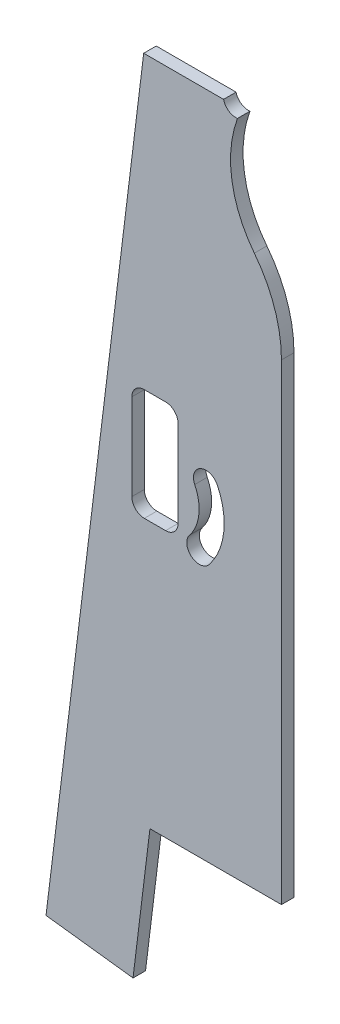
ISO-10303-21;
HEADER;
FILE_DESCRIPTION(('STEP AP214'),'2;1');
FILE_NAME('part.step','',(''),(''),'','','');
FILE_SCHEMA(('AUTOMOTIVE_DESIGN { 1 0 10303 214 1 1 1 1 }'));
ENDSEC;
DATA;
#1=APPLICATION_CONTEXT('core data for automotive mechanical design processes');
#2=APPLICATION_PROTOCOL_DEFINITION('international standard','automotive_design',2000,#1);
#3=PRODUCT_CONTEXT('',#1,'mechanical');
#4=PRODUCT('Part','Part','',(#3));
#5=PRODUCT_RELATED_PRODUCT_CATEGORY('part','',(#4));
#6=PRODUCT_DEFINITION_FORMATION('','',#4);
#7=PRODUCT_DEFINITION_CONTEXT('part definition',#1,'design');
#8=PRODUCT_DEFINITION('design','',#6,#7);
#9=PRODUCT_DEFINITION_SHAPE('','',#8);
#10=(LENGTH_UNIT() NAMED_UNIT(*) SI_UNIT(.MILLI.,.METRE.));
#11=(NAMED_UNIT(*) PLANE_ANGLE_UNIT() SI_UNIT($,.RADIAN.));
#12=(NAMED_UNIT(*) SI_UNIT($,.STERADIAN.) SOLID_ANGLE_UNIT());
#13=UNCERTAINTY_MEASURE_WITH_UNIT(LENGTH_MEASURE(1.E-05),#10,'distance_accuracy_value','');
#14=(GEOMETRIC_REPRESENTATION_CONTEXT(3) GLOBAL_UNCERTAINTY_ASSIGNED_CONTEXT((#13)) GLOBAL_UNIT_ASSIGNED_CONTEXT((#10,
#11,#12)) REPRESENTATION_CONTEXT('',''));
#15=CARTESIAN_POINT('',(0.,0.,0.));
#16=DIRECTION('',(0.,0.,1.));
#17=DIRECTION('',(1.,0.,0.));
#18=AXIS2_PLACEMENT_3D('',#15,#16,#17);
#19=CARTESIAN_POINT('',(0.,0.,6.35));
#20=DIRECTION('',(0.,0.,-1.));
#21=DIRECTION('',(-1.,0.,0.));
#22=AXIS2_PLACEMENT_3D('',#19,#20,#21);
#23=PLANE('',#22);
#24=CARTESIAN_POINT('',(30.6766730209772,334.935994433785,6.35));
#25=DIRECTION('',(0.,0.,-1.));
#26=DIRECTION('',(-1.,0.,0.));
#27=AXIS2_PLACEMENT_3D('',#24,#25,#26);
#28=CIRCLE('',#27,65.0874999999998);
#29=CARTESIAN_POINT('',(82.0161598908012,374.943990436998,6.35));
#30=VERTEX_POINT('',#29);
#31=CARTESIAN_POINT('',(95.764173020977,334.935994433782,6.35));
#32=VERTEX_POINT('',#31);
#33=EDGE_CURVE('E250',#30,#32,#28,.T.);
#34=ORIENTED_EDGE('',*,*,#33,.F.);
#35=CARTESIAN_POINT('',(127.09473372772,410.072962537381,6.35));
#36=DIRECTION('',(0.,0.,1.));
#37=DIRECTION('',(1.,0.,0.));
#38=AXIS2_PLACEMENT_3D('',#35,#36,#37);
#39=CIRCLE('',#38,57.15);
#40=CARTESIAN_POINT('',(73.4745637946517,429.846679344013,6.35));
#41=VERTEX_POINT('',#40);
#42=EDGE_CURVE('E194',#41,#30,#39,.T.);
#43=ORIENTED_EDGE('',*,*,#42,.F.);
#44=CARTESIAN_POINT('',(72.594859493668,436.13544872624,6.35));
#45=DIRECTION('',(0.,0.,1.));
#46=DIRECTION('',(1.,0.,0.));
#47=AXIS2_PLACEMENT_3D('',#44,#45,#46);
#48=CIRCLE('',#47,6.34999999999999);
#49=CARTESIAN_POINT('',(66.412753154869,434.684910475872,6.35));
#50=VERTEX_POINT('',#49);
#51=EDGE_CURVE('E287',#50,#41,#48,.T.);
#52=ORIENTED_EDGE('',*,*,#51,.F.);
#53=DIRECTION('',(-1.,0.,0.));
#54=VECTOR('',#53,1.);
#55=CARTESIAN_POINT('',(25.9141730209772,434.684910475872,6.35));
#56=LINE('',#55,#54);
#57=CARTESIAN_POINT('',(25.9141730209772,434.684910475872,6.35));
#58=VERTEX_POINT('',#57);
#59=EDGE_CURVE('E312',#50,#58,#56,.T.);
#60=ORIENTED_EDGE('',*,*,#59,.T.);
#61=DIRECTION('',(-0.121869343405144,-0.992546151641322,0.));
#62=VECTOR('',#61,1.);
#63=CARTESIAN_POINT('',(-23.6135281388733,31.3141544488385,6.35));
#64=LINE('',#63,#62);
#65=CARTESIAN_POINT('',(-23.6135281388733,31.3141544488385,6.35));
#66=VERTEX_POINT('',#65);
#67=EDGE_CURVE('E314',#58,#66,#64,.T.);
#68=ORIENTED_EDGE('',*,*,#67,.T.);
#69=DIRECTION('',(0.992546151641323,-0.121869343405143,0.));
#70=VECTOR('',#69,1.);
#71=CARTESIAN_POINT('',(20.5051483015834,25.8970621344799,6.35));
#72=LINE('',#71,#70);
#73=CARTESIAN_POINT('',(20.5051483015834,25.8970621344799,6.35));
#74=VERTEX_POINT('',#73);
#75=EDGE_CURVE('E316',#66,#74,#72,.T.);
#76=ORIENTED_EDGE('',*,*,#75,.T.);
#77=DIRECTION('',(0.121869343405143,0.992546151641323,0.));
#78=VECTOR('',#77,1.);
#79=CARTESIAN_POINT('',(29.081649880651,95.7470621344798,6.35));
#80=LINE('',#79,#78);
#81=CARTESIAN_POINT('',(29.081649880651,95.7470621344798,6.35));
#82=VERTEX_POINT('',#81);
#83=EDGE_CURVE('E303',#74,#82,#80,.T.);
#84=ORIENTED_EDGE('',*,*,#83,.T.);
#85=DIRECTION('',(1.,0.,0.));
#86=VECTOR('',#85,1.);
#87=CARTESIAN_POINT('',(95.7641730209773,95.7470621344799,6.35));
#88=LINE('',#87,#86);
#89=CARTESIAN_POINT('',(95.7641730209773,95.7470621344799,6.35));
#90=VERTEX_POINT('',#89);
#91=EDGE_CURVE('E306',#82,#90,#88,.T.);
#92=ORIENTED_EDGE('',*,*,#91,.T.);
#93=DIRECTION('',(0.,1.,0.));
#94=VECTOR('',#93,1.);
#95=CARTESIAN_POINT('',(95.7641730209773,95.7470621344799,6.35));
#96=LINE('',#95,#94);
#97=EDGE_CURVE('E309',#90,#32,#96,.T.);
#98=ORIENTED_EDGE('',*,*,#97,.T.);
#99=EDGE_LOOP('',(#34,#43,#52,#60,#68,#76,#84,#92,#98));
#100=FACE_BOUND('',#99,.T.);
#101=CARTESIAN_POINT('',(57.4996611278624,261.012649670213,6.35));
#102=DIRECTION('',(0.,0.,1.));
#103=DIRECTION('',(1.,0.,0.));
#104=AXIS2_PLACEMENT_3D('',#101,#102,#103);
#105=CIRCLE('',#104,6.34999999999979);
#106=CARTESIAN_POINT('',(63.2131029293924,263.783765470847,6.35));
#107=VERTEX_POINT('',#106);
#108=CARTESIAN_POINT('',(51.7862193263348,258.241533869578,6.35));
#109=VERTEX_POINT('',#108);
#110=EDGE_CURVE('E277',#107,#109,#105,.T.);
#111=ORIENTED_EDGE('',*,*,#110,.F.);
#112=CARTESIAN_POINT('',(31.7891730209766,248.542628567356,6.35));
#113=DIRECTION('',(0.,0.,1.));
#114=DIRECTION('',(1.,0.,0.));
#115=AXIS2_PLACEMENT_3D('',#112,#113,#114);
#116=CIRCLE('',#115,34.9249999999999);
#117=CARTESIAN_POINT('',(59.0699609703519,226.736339707002,6.35));
#118=VERTEX_POINT('',#117);
#119=EDGE_CURVE('E259',#118,#107,#116,.T.);
#120=ORIENTED_EDGE('',*,*,#119,.F.);
#121=CARTESIAN_POINT('',(54.1098177068291,230.701119499794,6.35));
#122=DIRECTION('',(0.,0.,1.));
#123=DIRECTION('',(1.,0.,0.));
#124=AXIS2_PLACEMENT_3D('',#121,#122,#123);
#125=CIRCLE('',#124,6.34999999999796);
#126=CARTESIAN_POINT('',(49.1496744433093,234.665899292585,6.35));
#127=VERTEX_POINT('',#126);
#128=EDGE_CURVE('E266',#127,#118,#125,.T.);
#129=ORIENTED_EDGE('',*,*,#128,.F.);
#130=CARTESIAN_POINT('',(31.7891730209766,248.542628567356,6.35));
#131=DIRECTION('',(0.,0.,1.));
#132=DIRECTION('',(1.,0.,0.));
#133=AXIS2_PLACEMENT_3D('',#130,#131,#132);
#134=CIRCLE('',#133,22.2250000000022);
#135=EDGE_CURVE('E280',#127,#109,#134,.T.);
#136=ORIENTED_EDGE('',*,*,#135,.T.);
#137=EDGE_LOOP('',(#111,#120,#129,#136));
#138=FACE_BOUND('',#137,.T.);
#139=DIRECTION('',(1.,0.,0.));
#140=VECTOR('',#139,1.);
#141=CARTESIAN_POINT('',(26.2316730209777,287.120128567355,6.35));
#142=LINE('',#141,#140);
#143=CARTESIAN_POINT('',(26.2316730209777,287.120128567355,6.35));
#144=VERTEX_POINT('',#143);
#145=CARTESIAN_POINT('',(37.0266730209772,287.120128567355,6.35));
#146=VERTEX_POINT('',#145);
#147=EDGE_CURVE('E50',#144,#146,#142,.T.);
#148=ORIENTED_EDGE('',*,*,#147,.T.);
#149=CARTESIAN_POINT('',(37.0266730209772,280.770128567355,6.35));
#150=DIRECTION('',(0.,0.,-1.));
#151=DIRECTION('',(-1.,0.,0.));
#152=AXIS2_PLACEMENT_3D('',#149,#150,#151);
#153=CIRCLE('',#152,6.35000000000004);
#154=CARTESIAN_POINT('',(43.3766730209772,280.770128567355,6.35));
#155=VERTEX_POINT('',#154);
#156=EDGE_CURVE('E193',#146,#155,#153,.T.);
#157=ORIENTED_EDGE('',*,*,#156,.T.);
#158=DIRECTION('',(0.,-1.,0.));
#159=VECTOR('',#158,1.);
#160=CARTESIAN_POINT('',(43.3766730209772,280.770128567355,6.35));
#161=LINE('',#160,#159);
#162=CARTESIAN_POINT('',(43.3766730209772,236.955128567356,6.35));
#163=VERTEX_POINT('',#162);
#164=EDGE_CURVE('E217',#155,#163,#161,.T.);
#165=ORIENTED_EDGE('',*,*,#164,.T.);
#166=CARTESIAN_POINT('',(37.0266730209772,236.955128567356,6.35));
#167=DIRECTION('',(0.,0.,1.));
#168=DIRECTION('',(1.,0.,0.));
#169=AXIS2_PLACEMENT_3D('',#166,#167,#168);
#170=CIRCLE('',#169,6.34999999999999);
#171=CARTESIAN_POINT('',(37.0266730209772,230.605128567356,6.35));
#172=VERTEX_POINT('',#171);
#173=EDGE_CURVE('E220',#172,#163,#170,.T.);
#174=ORIENTED_EDGE('',*,*,#173,.F.);
#175=DIRECTION('',(1.,0.,0.));
#176=VECTOR('',#175,1.);
#177=CARTESIAN_POINT('',(26.2316730209777,230.605128567356,6.35));
#178=LINE('',#177,#176);
#179=CARTESIAN_POINT('',(26.2316730209777,230.605128567356,6.35));
#180=VERTEX_POINT('',#179);
#181=EDGE_CURVE('E223',#180,#172,#178,.T.);
#182=ORIENTED_EDGE('',*,*,#181,.F.);
#183=CARTESIAN_POINT('',(26.2316730209777,236.955128567356,6.35));
#184=DIRECTION('',(0.,0.,1.));
#185=DIRECTION('',(1.,0.,0.));
#186=AXIS2_PLACEMENT_3D('',#183,#184,#185);
#187=CIRCLE('',#186,6.35);
#188=CARTESIAN_POINT('',(19.8816730209777,236.955128567356,6.35));
#189=VERTEX_POINT('',#188);
#190=EDGE_CURVE('E226',#189,#180,#187,.T.);
#191=ORIENTED_EDGE('',*,*,#190,.F.);
#192=DIRECTION('',(0.,-1.,0.));
#193=VECTOR('',#192,1.);
#194=CARTESIAN_POINT('',(19.8816730209777,280.770128567355,6.35));
#195=LINE('',#194,#193);
#196=CARTESIAN_POINT('',(19.8816730209777,280.770128567355,6.35));
#197=VERTEX_POINT('',#196);
#198=EDGE_CURVE('E229',#197,#189,#195,.T.);
#199=ORIENTED_EDGE('',*,*,#198,.F.);
#200=CARTESIAN_POINT('',(26.2316730209777,280.770128567355,6.35));
#201=DIRECTION('',(0.,0.,1.));
#202=DIRECTION('',(1.,0.,0.));
#203=AXIS2_PLACEMENT_3D('',#200,#201,#202);
#204=CIRCLE('',#203,6.35000000000001);
#205=EDGE_CURVE('E187',#144,#197,#204,.T.);
#206=ORIENTED_EDGE('',*,*,#205,.F.);
#207=EDGE_LOOP('',(#148,#157,#165,#174,#182,#191,#199,#206));
#208=FACE_BOUND('',#207,.T.);
#209=ADVANCED_FACE('F35',(#100,#138,#208),#23,.F.);
#210=CARTESIAN_POINT('',(0.,0.,0.));
#211=DIRECTION('',(0.,0.,-1.));
#212=DIRECTION('',(-1.,0.,0.));
#213=AXIS2_PLACEMENT_3D('',#210,#211,#212);
#214=PLANE('',#213);
#215=CARTESIAN_POINT('',(31.7891730209766,248.542628567356,0.));
#216=DIRECTION('',(0.,0.,1.));
#217=DIRECTION('',(1.,0.,0.));
#218=AXIS2_PLACEMENT_3D('',#215,#216,#217);
#219=CIRCLE('',#218,34.9249999999999);
#220=CARTESIAN_POINT('',(59.0699609703519,226.736339707002,0.));
#221=VERTEX_POINT('',#220);
#222=CARTESIAN_POINT('',(63.2131029293925,263.783765470847,0.));
#223=VERTEX_POINT('',#222);
#224=EDGE_CURVE('E262',#221,#223,#219,.T.);
#225=ORIENTED_EDGE('',*,*,#224,.T.);
#226=CARTESIAN_POINT('',(57.4996611278624,261.012649670213,0.));
#227=DIRECTION('',(0.,0.,1.));
#228=DIRECTION('',(1.,0.,0.));
#229=AXIS2_PLACEMENT_3D('',#226,#227,#228);
#230=CIRCLE('',#229,6.34999999999979);
#231=CARTESIAN_POINT('',(51.786219326333,258.241533869577,0.));
#232=VERTEX_POINT('',#231);
#233=EDGE_CURVE('E265',#223,#232,#230,.T.);
#234=ORIENTED_EDGE('',*,*,#233,.T.);
#235=CARTESIAN_POINT('',(31.7891730209766,248.542628567356,0.));
#236=DIRECTION('',(0.,0.,1.));
#237=DIRECTION('',(1.,0.,0.));
#238=AXIS2_PLACEMENT_3D('',#235,#236,#237);
#239=CIRCLE('',#238,22.2250000000022);
#240=CARTESIAN_POINT('',(49.1496744433093,234.665899292585,0.));
#241=VERTEX_POINT('',#240);
#242=EDGE_CURVE('E269',#241,#232,#239,.T.);
#243=ORIENTED_EDGE('',*,*,#242,.F.);
#244=CARTESIAN_POINT('',(54.1098177068291,230.701119499794,0.));
#245=DIRECTION('',(0.,0.,1.));
#246=DIRECTION('',(1.,0.,0.));
#247=AXIS2_PLACEMENT_3D('',#244,#245,#246);
#248=CIRCLE('',#247,6.34999999999796);
#249=EDGE_CURVE('E272',#241,#221,#248,.T.);
#250=ORIENTED_EDGE('',*,*,#249,.T.);
#251=EDGE_LOOP('',(#225,#234,#243,#250));
#252=FACE_BOUND('',#251,.T.);
#253=CARTESIAN_POINT('',(127.09473372772,410.072962537381,0.));
#254=DIRECTION('',(0.,0.,1.));
#255=DIRECTION('',(1.,0.,0.));
#256=AXIS2_PLACEMENT_3D('',#253,#254,#255);
#257=CIRCLE('',#256,57.15);
#258=CARTESIAN_POINT('',(73.4745637946517,429.846679344013,0.));
#259=VERTEX_POINT('',#258);
#260=CARTESIAN_POINT('',(82.0161598908012,374.943990436998,0.));
#261=VERTEX_POINT('',#260);
#262=EDGE_CURVE('E246',#259,#261,#257,.T.);
#263=ORIENTED_EDGE('',*,*,#262,.T.);
#264=CARTESIAN_POINT('',(30.6766730209772,334.935994433785,0.));
#265=DIRECTION('',(0.,0.,-1.));
#266=DIRECTION('',(-1.,0.,0.));
#267=AXIS2_PLACEMENT_3D('',#264,#265,#266);
#268=CIRCLE('',#267,65.0874999999998);
#269=CARTESIAN_POINT('',(95.764173020977,334.935994433782,0.));
#270=VERTEX_POINT('',#269);
#271=EDGE_CURVE('E249',#261,#270,#268,.T.);
#272=ORIENTED_EDGE('',*,*,#271,.T.);
#273=DIRECTION('',(0.,1.,0.));
#274=VECTOR('',#273,1.);
#275=CARTESIAN_POINT('',(95.7641730209773,95.7470621344799,0.));
#276=LINE('',#275,#274);
#277=CARTESIAN_POINT('',(95.7641730209773,95.7470621344799,0.));
#278=VERTEX_POINT('',#277);
#279=EDGE_CURVE('E323',#278,#270,#276,.T.);
#280=ORIENTED_EDGE('',*,*,#279,.F.);
#281=DIRECTION('',(1.,0.,0.));
#282=VECTOR('',#281,1.);
#283=CARTESIAN_POINT('',(95.7641730209773,95.7470621344799,0.));
#284=LINE('',#283,#282);
#285=CARTESIAN_POINT('',(29.081649880651,95.7470621344798,0.));
#286=VERTEX_POINT('',#285);
#287=EDGE_CURVE('E321',#286,#278,#284,.T.);
#288=ORIENTED_EDGE('',*,*,#287,.F.);
#289=DIRECTION('',(0.121869343405143,0.992546151641323,0.));
#290=VECTOR('',#289,1.);
#291=CARTESIAN_POINT('',(29.081649880651,95.7470621344798,0.));
#292=LINE('',#291,#290);
#293=CARTESIAN_POINT('',(20.5051483015834,25.8970621344799,0.));
#294=VERTEX_POINT('',#293);
#295=EDGE_CURVE('E302',#294,#286,#292,.T.);
#296=ORIENTED_EDGE('',*,*,#295,.F.);
#297=DIRECTION('',(0.992546151641323,-0.121869343405143,0.));
#298=VECTOR('',#297,1.);
#299=CARTESIAN_POINT('',(20.5051483015834,25.8970621344799,0.));
#300=LINE('',#299,#298);
#301=CARTESIAN_POINT('',(-23.6135281388733,31.3141544488385,0.));
#302=VERTEX_POINT('',#301);
#303=EDGE_CURVE('E307',#302,#294,#300,.T.);
#304=ORIENTED_EDGE('',*,*,#303,.F.);
#305=DIRECTION('',(-0.121869343405144,-0.992546151641322,0.));
#306=VECTOR('',#305,1.);
#307=CARTESIAN_POINT('',(-23.6135281388733,31.3141544488385,0.));
#308=LINE('',#307,#306);
#309=CARTESIAN_POINT('',(25.9141730209772,434.684910475872,0.));
#310=VERTEX_POINT('',#309);
#311=EDGE_CURVE('E328',#310,#302,#308,.T.);
#312=ORIENTED_EDGE('',*,*,#311,.F.);
#313=DIRECTION('',(-1.,0.,0.));
#314=VECTOR('',#313,1.);
#315=CARTESIAN_POINT('',(25.9141730209772,434.684910475872,0.));
#316=LINE('',#315,#314);
#317=CARTESIAN_POINT('',(66.412753154869,434.684910475872,0.));
#318=VERTEX_POINT('',#317);
#319=EDGE_CURVE('E326',#318,#310,#316,.T.);
#320=ORIENTED_EDGE('',*,*,#319,.F.);
#321=CARTESIAN_POINT('',(72.594859493668,436.13544872624,0.));
#322=DIRECTION('',(0.,0.,1.));
#323=DIRECTION('',(1.,0.,0.));
#324=AXIS2_PLACEMENT_3D('',#321,#322,#323);
#325=CIRCLE('',#324,6.34999999999999);
#326=EDGE_CURVE('E294',#318,#259,#325,.T.);
#327=ORIENTED_EDGE('',*,*,#326,.T.);
#328=EDGE_LOOP('',(#263,#272,#280,#288,#296,#304,#312,#320,#327));
#329=FACE_BOUND('',#328,.T.);
#330=CARTESIAN_POINT('',(37.0266730209772,280.770128567355,0.));
#331=DIRECTION('',(0.,0.,-1.));
#332=DIRECTION('',(-1.,0.,0.));
#333=AXIS2_PLACEMENT_3D('',#330,#331,#332);
#334=CIRCLE('',#333,6.35000000000004);
#335=CARTESIAN_POINT('',(37.0266730209772,287.120128567355,0.));
#336=VERTEX_POINT('',#335);
#337=CARTESIAN_POINT('',(43.3766730209772,280.770128567355,0.));
#338=VERTEX_POINT('',#337);
#339=EDGE_CURVE('E186',#336,#338,#334,.T.);
#340=ORIENTED_EDGE('',*,*,#339,.F.);
#341=DIRECTION('',(1.,0.,0.));
#342=VECTOR('',#341,1.);
#343=CARTESIAN_POINT('',(26.2316730209777,287.120128567355,0.));
#344=LINE('',#343,#342);
#345=CARTESIAN_POINT('',(26.2316730209777,287.120128567355,0.));
#346=VERTEX_POINT('',#345);
#347=EDGE_CURVE('E177',#346,#336,#344,.T.);
#348=ORIENTED_EDGE('',*,*,#347,.F.);
#349=CARTESIAN_POINT('',(26.2316730209777,280.770128567355,0.));
#350=DIRECTION('',(0.,0.,1.));
#351=DIRECTION('',(1.,0.,0.));
#352=AXIS2_PLACEMENT_3D('',#349,#350,#351);
#353=CIRCLE('',#352,6.35000000000001);
#354=CARTESIAN_POINT('',(19.8816730209777,280.770128567355,0.));
#355=VERTEX_POINT('',#354);
#356=EDGE_CURVE('E213',#346,#355,#353,.T.);
#357=ORIENTED_EDGE('',*,*,#356,.T.);
#358=DIRECTION('',(0.,-1.,0.));
#359=VECTOR('',#358,1.);
#360=CARTESIAN_POINT('',(19.8816730209777,280.770128567355,0.));
#361=LINE('',#360,#359);
#362=CARTESIAN_POINT('',(19.8816730209777,236.955128567356,0.));
#363=VERTEX_POINT('',#362);
#364=EDGE_CURVE('E58',#355,#363,#361,.T.);
#365=ORIENTED_EDGE('',*,*,#364,.T.);
#366=CARTESIAN_POINT('',(26.2316730209777,236.955128567356,0.));
#367=DIRECTION('',(0.,0.,1.));
#368=DIRECTION('',(1.,0.,0.));
#369=AXIS2_PLACEMENT_3D('',#366,#367,#368);
#370=CIRCLE('',#369,6.35);
#371=CARTESIAN_POINT('',(26.2316730209777,230.605128567356,0.));
#372=VERTEX_POINT('',#371);
#373=EDGE_CURVE('E209',#363,#372,#370,.T.);
#374=ORIENTED_EDGE('',*,*,#373,.T.);
#375=DIRECTION('',(1.,0.,0.));
#376=VECTOR('',#375,1.);
#377=CARTESIAN_POINT('',(26.2316730209777,230.605128567356,0.));
#378=LINE('',#377,#376);
#379=CARTESIAN_POINT('',(37.0266730209772,230.605128567356,0.));
#380=VERTEX_POINT('',#379);
#381=EDGE_CURVE('E206',#372,#380,#378,.T.);
#382=ORIENTED_EDGE('',*,*,#381,.T.);
#383=CARTESIAN_POINT('',(37.0266730209772,236.955128567356,0.));
#384=DIRECTION('',(0.,0.,1.));
#385=DIRECTION('',(1.,0.,0.));
#386=AXIS2_PLACEMENT_3D('',#383,#384,#385);
#387=CIRCLE('',#386,6.34999999999999);
#388=CARTESIAN_POINT('',(43.3766730209772,236.955128567356,0.));
#389=VERTEX_POINT('',#388);
#390=EDGE_CURVE('E202',#380,#389,#387,.T.);
#391=ORIENTED_EDGE('',*,*,#390,.T.);
#392=DIRECTION('',(0.,-1.,0.));
#393=VECTOR('',#392,1.);
#394=CARTESIAN_POINT('',(43.3766730209772,280.770128567355,0.));
#395=LINE('',#394,#393);
#396=EDGE_CURVE('E200',#338,#389,#395,.T.);
#397=ORIENTED_EDGE('',*,*,#396,.F.);
#398=EDGE_LOOP('',(#340,#348,#357,#365,#374,#382,#391,#397));
#399=FACE_BOUND('',#398,.T.);
#400=ADVANCED_FACE('F198',(#252,#329,#399),#214,.T.);
#401=CARTESIAN_POINT('',(95.7641730209773,95.7470621344799,6.35));
#402=DIRECTION('',(-1.,0.,0.));
#403=DIRECTION('',(0.,-1.,0.));
#404=AXIS2_PLACEMENT_3D('',#401,#402,#403);
#405=PLANE('',#404);
#406=DIRECTION('',(0.,0.,1.));
#407=VECTOR('',#406,1.);
#408=CARTESIAN_POINT('',(95.764173020977,334.935994433782,0.));
#409=LINE('',#408,#407);
#410=EDGE_CURVE('E256',#270,#32,#409,.T.);
#411=ORIENTED_EDGE('',*,*,#410,.T.);
#412=ORIENTED_EDGE('',*,*,#97,.F.);
#413=DIRECTION('',(0.,0.,-1.));
#414=VECTOR('',#413,1.);
#415=CARTESIAN_POINT('',(95.7641730209773,95.7470621344799,6.35));
#416=LINE('',#415,#414);
#417=EDGE_CURVE('E339',#90,#278,#416,.T.);
#418=ORIENTED_EDGE('',*,*,#417,.T.);
#419=ORIENTED_EDGE('',*,*,#279,.T.);
#420=EDGE_LOOP('',(#411,#412,#418,#419));
#421=FACE_BOUND('',#420,.T.);
#422=ADVANCED_FACE('F356',(#421),#405,.F.);
#423=CARTESIAN_POINT('',(29.081649880651,95.7470621344798,6.35));
#424=DIRECTION('',(-0.992546151641323,0.121869343405143,0.));
#425=DIRECTION('',(-0.121869343405143,-0.992546151641323,0.));
#426=AXIS2_PLACEMENT_3D('',#423,#424,#425);
#427=PLANE('',#426);
#428=ORIENTED_EDGE('',*,*,#295,.T.);
#429=DIRECTION('',(0.,0.,-1.));
#430=VECTOR('',#429,1.);
#431=CARTESIAN_POINT('',(29.081649880651,95.7470621344798,6.35));
#432=LINE('',#431,#430);
#433=EDGE_CURVE('E43',#82,#286,#432,.T.);
#434=ORIENTED_EDGE('',*,*,#433,.F.);
#435=ORIENTED_EDGE('',*,*,#83,.F.);
#436=DIRECTION('',(0.,0.,-1.));
#437=VECTOR('',#436,1.);
#438=CARTESIAN_POINT('',(20.5051483015834,25.8970621344799,6.35));
#439=LINE('',#438,#437);
#440=EDGE_CURVE('E318',#74,#294,#439,.T.);
#441=ORIENTED_EDGE('',*,*,#440,.T.);
#442=EDGE_LOOP('',(#428,#434,#435,#441));
#443=FACE_BOUND('',#442,.T.);
#444=ADVANCED_FACE('F37',(#443),#427,.F.);
#445=CARTESIAN_POINT('',(95.7641730209773,95.7470621344799,6.35));
#446=DIRECTION('',(0.,1.,0.));
#447=DIRECTION('',(-1.,0.,0.));
#448=AXIS2_PLACEMENT_3D('',#445,#446,#447);
#449=PLANE('',#448);
#450=ORIENTED_EDGE('',*,*,#287,.T.);
#451=ORIENTED_EDGE('',*,*,#417,.F.);
#452=ORIENTED_EDGE('',*,*,#91,.F.);
#453=ORIENTED_EDGE('',*,*,#433,.T.);
#454=EDGE_LOOP('',(#450,#451,#452,#453));
#455=FACE_BOUND('',#454,.T.);
#456=ADVANCED_FACE('F344',(#455),#449,.F.);
#457=CARTESIAN_POINT('',(25.9141730209772,434.684910475872,6.35));
#458=DIRECTION('',(0.,-1.,0.));
#459=DIRECTION('',(1.,0.,0.));
#460=AXIS2_PLACEMENT_3D('',#457,#458,#459);
#461=PLANE('',#460);
#462=ORIENTED_EDGE('',*,*,#59,.F.);
#463=DIRECTION('',(0.,0.,1.));
#464=VECTOR('',#463,1.);
#465=CARTESIAN_POINT('',(66.412753154869,434.684910475872,0.));
#466=LINE('',#465,#464);
#467=EDGE_CURVE('E297',#50,#318,#466,.F.);
#468=ORIENTED_EDGE('',*,*,#467,.T.);
#469=ORIENTED_EDGE('',*,*,#319,.T.);
#470=DIRECTION('',(0.,0.,-1.));
#471=VECTOR('',#470,1.);
#472=CARTESIAN_POINT('',(25.9141730209772,434.684910475872,6.35));
#473=LINE('',#472,#471);
#474=EDGE_CURVE('E336',#58,#310,#473,.T.);
#475=ORIENTED_EDGE('',*,*,#474,.F.);
#476=EDGE_LOOP('',(#462,#468,#469,#475));
#477=FACE_BOUND('',#476,.T.);
#478=ADVANCED_FACE('F373',(#477),#461,.F.);
#479=CARTESIAN_POINT('',(-23.6135281388733,31.3141544488385,6.35));
#480=DIRECTION('',(0.992546151641322,-0.121869343405144,0.));
#481=DIRECTION('',(0.121869343405144,0.992546151641322,0.));
#482=AXIS2_PLACEMENT_3D('',#479,#480,#481);
#483=PLANE('',#482);
#484=ORIENTED_EDGE('',*,*,#311,.T.);
#485=DIRECTION('',(0.,0.,-1.));
#486=VECTOR('',#485,1.);
#487=CARTESIAN_POINT('',(-23.6135281388733,31.3141544488385,6.35));
#488=LINE('',#487,#486);
#489=EDGE_CURVE('E333',#66,#302,#488,.T.);
#490=ORIENTED_EDGE('',*,*,#489,.F.);
#491=ORIENTED_EDGE('',*,*,#67,.F.);
#492=ORIENTED_EDGE('',*,*,#474,.T.);
#493=EDGE_LOOP('',(#484,#490,#491,#492));
#494=FACE_BOUND('',#493,.T.);
#495=ADVANCED_FACE('F368',(#494),#483,.F.);
#496=CARTESIAN_POINT('',(20.5051483015834,25.8970621344799,6.35));
#497=DIRECTION('',(0.121869343405143,0.992546151641323,0.));
#498=DIRECTION('',(-0.992546151641323,0.121869343405143,0.));
#499=AXIS2_PLACEMENT_3D('',#496,#497,#498);
#500=PLANE('',#499);
#501=ORIENTED_EDGE('',*,*,#303,.T.);
#502=ORIENTED_EDGE('',*,*,#440,.F.);
#503=ORIENTED_EDGE('',*,*,#75,.F.);
#504=ORIENTED_EDGE('',*,*,#489,.T.);
#505=EDGE_LOOP('',(#501,#502,#503,#504));
#506=FACE_BOUND('',#505,.T.);
#507=ADVANCED_FACE('F366',(#506),#500,.F.);
#508=CARTESIAN_POINT('',(72.594859493668,436.13544872624,0.));
#509=DIRECTION('',(0.,0.,1.));
#510=DIRECTION('',(1.,0.,0.));
#511=AXIS2_PLACEMENT_3D('',#508,#509,#510);
#512=CYLINDRICAL_SURFACE('',#511,6.34999999999999);
#513=ORIENTED_EDGE('',*,*,#51,.T.);
#514=DIRECTION('',(0.,0.,1.));
#515=VECTOR('',#514,1.);
#516=CARTESIAN_POINT('',(73.4745637946517,429.846679344013,3.175));
#517=LINE('',#516,#515);
#518=EDGE_CURVE('E11',#41,#259,#517,.F.);
#519=ORIENTED_EDGE('',*,*,#518,.T.);
#520=ORIENTED_EDGE('',*,*,#326,.F.);
#521=ORIENTED_EDGE('',*,*,#467,.F.);
#522=EDGE_LOOP('',(#513,#519,#520,#521));
#523=FACE_BOUND('',#522,.T.);
#524=ADVANCED_FACE('F376',(#523),#512,.F.);
#525=CARTESIAN_POINT('',(31.7891730209766,248.542628567356,0.));
#526=DIRECTION('',(0.,0.,1.));
#527=DIRECTION('',(1.,0.,0.));
#528=AXIS2_PLACEMENT_3D('',#525,#526,#527);
#529=CYLINDRICAL_SURFACE('',#528,34.9249999999999);
#530=ORIENTED_EDGE('',*,*,#119,.T.);
#531=DIRECTION('',(0.,0.,1.));
#532=VECTOR('',#531,1.);
#533=CARTESIAN_POINT('',(63.2131029293925,263.783765470847,0.));
#534=LINE('',#533,#532);
#535=EDGE_CURVE('E275',#223,#107,#534,.T.);
#536=ORIENTED_EDGE('',*,*,#535,.F.);
#537=ORIENTED_EDGE('',*,*,#224,.F.);
#538=DIRECTION('',(0.,0.,1.));
#539=VECTOR('',#538,1.);
#540=CARTESIAN_POINT('',(59.0699609703519,226.736339707002,0.));
#541=LINE('',#540,#539);
#542=EDGE_CURVE('E285',#221,#118,#541,.T.);
#543=ORIENTED_EDGE('',*,*,#542,.T.);
#544=EDGE_LOOP('',(#530,#536,#537,#543));
#545=FACE_BOUND('',#544,.T.);
#546=ADVANCED_FACE('F440',(#545),#529,.F.);
#547=CARTESIAN_POINT('',(54.1098177068291,230.701119499794,0.));
#548=DIRECTION('',(0.,0.,1.));
#549=DIRECTION('',(1.,0.,0.));
#550=AXIS2_PLACEMENT_3D('',#547,#548,#549);
#551=CYLINDRICAL_SURFACE('',#550,6.34999999999796);
#552=ORIENTED_EDGE('',*,*,#128,.T.);
#553=ORIENTED_EDGE('',*,*,#542,.F.);
#554=ORIENTED_EDGE('',*,*,#249,.F.);
#555=DIRECTION('',(0.,0.,1.));
#556=VECTOR('',#555,1.);
#557=CARTESIAN_POINT('',(49.1496744433093,234.665899292585,0.));
#558=LINE('',#557,#556);
#559=EDGE_CURVE('E288',#241,#127,#558,.T.);
#560=ORIENTED_EDGE('',*,*,#559,.T.);
#561=EDGE_LOOP('',(#552,#553,#554,#560));
#562=FACE_BOUND('',#561,.T.);
#563=ADVANCED_FACE('F445',(#562),#551,.F.);
#564=CARTESIAN_POINT('',(31.7891730209766,248.542628567356,0.));
#565=DIRECTION('',(0.,0.,1.));
#566=DIRECTION('',(1.,0.,0.));
#567=AXIS2_PLACEMENT_3D('',#564,#565,#566);
#568=CYLINDRICAL_SURFACE('',#567,22.2250000000022);
#569=ORIENTED_EDGE('',*,*,#135,.F.);
#570=ORIENTED_EDGE('',*,*,#559,.F.);
#571=ORIENTED_EDGE('',*,*,#242,.T.);
#572=DIRECTION('',(0.,0.,1.));
#573=VECTOR('',#572,1.);
#574=CARTESIAN_POINT('',(51.7862193263348,258.241533869578,0.));
#575=LINE('',#574,#573);
#576=EDGE_CURVE('E290',#232,#109,#575,.T.);
#577=ORIENTED_EDGE('',*,*,#576,.T.);
#578=EDGE_LOOP('',(#569,#570,#571,#577));
#579=FACE_BOUND('',#578,.T.);
#580=ADVANCED_FACE('F455',(#579),#568,.T.);
#581=CARTESIAN_POINT('',(57.4996611278624,261.012649670213,0.));
#582=DIRECTION('',(0.,0.,1.));
#583=DIRECTION('',(1.,0.,0.));
#584=AXIS2_PLACEMENT_3D('',#581,#582,#583);
#585=CYLINDRICAL_SURFACE('',#584,6.34999999999979);
#586=ORIENTED_EDGE('',*,*,#110,.T.);
#587=ORIENTED_EDGE('',*,*,#576,.F.);
#588=ORIENTED_EDGE('',*,*,#233,.F.);
#589=ORIENTED_EDGE('',*,*,#535,.T.);
#590=EDGE_LOOP('',(#586,#587,#588,#589));
#591=FACE_BOUND('',#590,.T.);
#592=ADVANCED_FACE('F388',(#591),#585,.F.);
#593=CARTESIAN_POINT('',(127.09473372772,410.072962537381,0.));
#594=DIRECTION('',(0.,0.,1.));
#595=DIRECTION('',(1.,0.,0.));
#596=AXIS2_PLACEMENT_3D('',#593,#594,#595);
#597=CYLINDRICAL_SURFACE('',#596,57.15);
#598=ORIENTED_EDGE('',*,*,#42,.T.);
#599=DIRECTION('',(0.,0.,1.));
#600=VECTOR('',#599,1.);
#601=CARTESIAN_POINT('',(82.0161598908012,374.943990436998,0.));
#602=LINE('',#601,#600);
#603=EDGE_CURVE('E253',#261,#30,#602,.T.);
#604=ORIENTED_EDGE('',*,*,#603,.F.);
#605=ORIENTED_EDGE('',*,*,#262,.F.);
#606=ORIENTED_EDGE('',*,*,#518,.F.);
#607=EDGE_LOOP('',(#598,#604,#605,#606));
#608=FACE_BOUND('',#607,.T.);
#609=ADVANCED_FACE('F378',(#608),#597,.F.);
#610=CARTESIAN_POINT('',(30.6766730209772,334.935994433785,0.));
#611=DIRECTION('',(0.,0.,1.));
#612=DIRECTION('',(1.,0.,0.));
#613=AXIS2_PLACEMENT_3D('',#610,#611,#612);
#614=CYLINDRICAL_SURFACE('',#613,65.0874999999998);
#615=ORIENTED_EDGE('',*,*,#33,.T.);
#616=ORIENTED_EDGE('',*,*,#410,.F.);
#617=ORIENTED_EDGE('',*,*,#271,.F.);
#618=ORIENTED_EDGE('',*,*,#603,.T.);
#619=EDGE_LOOP('',(#615,#616,#617,#618));
#620=FACE_BOUND('',#619,.T.);
#621=ADVANCED_FACE('F380',(#620),#614,.T.);
#622=CARTESIAN_POINT('',(26.2316730209777,287.120128567355,0.));
#623=DIRECTION('',(0.,-1.,0.));
#624=DIRECTION('',(1.,0.,0.));
#625=AXIS2_PLACEMENT_3D('',#622,#623,#624);
#626=PLANE('',#625);
#627=ORIENTED_EDGE('',*,*,#147,.F.);
#628=DIRECTION('',(0.,0.,1.));
#629=VECTOR('',#628,1.);
#630=CARTESIAN_POINT('',(26.2316730209777,287.120128567355,0.));
#631=LINE('',#630,#629);
#632=EDGE_CURVE('E181',#346,#144,#631,.T.);
#633=ORIENTED_EDGE('',*,*,#632,.F.);
#634=ORIENTED_EDGE('',*,*,#347,.T.);
#635=DIRECTION('',(0.,0.,1.));
#636=VECTOR('',#635,1.);
#637=CARTESIAN_POINT('',(37.0266730209772,287.120128567355,0.));
#638=LINE('',#637,#636);
#639=EDGE_CURVE('E180',#336,#146,#638,.T.);
#640=ORIENTED_EDGE('',*,*,#639,.T.);
#641=EDGE_LOOP('',(#627,#633,#634,#640));
#642=FACE_BOUND('',#641,.T.);
#643=ADVANCED_FACE('F179',(#642),#626,.T.);
#644=CARTESIAN_POINT('',(37.0266730209772,280.770128567355,0.));
#645=DIRECTION('',(0.,0.,1.));
#646=DIRECTION('',(1.,0.,0.));
#647=AXIS2_PLACEMENT_3D('',#644,#645,#646);
#648=CYLINDRICAL_SURFACE('',#647,6.35000000000004);
#649=ORIENTED_EDGE('',*,*,#156,.F.);
#650=ORIENTED_EDGE('',*,*,#639,.F.);
#651=ORIENTED_EDGE('',*,*,#339,.T.);
#652=DIRECTION('',(0.,0.,1.));
#653=VECTOR('',#652,1.);
#654=CARTESIAN_POINT('',(43.3766730209772,280.770128567355,0.));
#655=LINE('',#654,#653);
#656=EDGE_CURVE('E195',#338,#155,#655,.T.);
#657=ORIENTED_EDGE('',*,*,#656,.T.);
#658=EDGE_LOOP('',(#649,#650,#651,#657));
#659=FACE_BOUND('',#658,.T.);
#660=ADVANCED_FACE('F190',(#659),#648,.F.);
#661=CARTESIAN_POINT('',(43.3766730209772,280.770128567355,0.));
#662=DIRECTION('',(-1.,0.,0.));
#663=DIRECTION('',(0.,0.,1.));
#664=AXIS2_PLACEMENT_3D('',#661,#662,#663);
#665=PLANE('',#664);
#666=ORIENTED_EDGE('',*,*,#164,.F.);
#667=ORIENTED_EDGE('',*,*,#656,.F.);
#668=ORIENTED_EDGE('',*,*,#396,.T.);
#669=DIRECTION('',(0.,0.,1.));
#670=VECTOR('',#669,1.);
#671=CARTESIAN_POINT('',(43.3766730209772,236.955128567356,0.));
#672=LINE('',#671,#670);
#673=EDGE_CURVE('E243',#389,#163,#672,.T.);
#674=ORIENTED_EDGE('',*,*,#673,.T.);
#675=EDGE_LOOP('',(#666,#667,#668,#674));
#676=FACE_BOUND('',#675,.T.);
#677=ADVANCED_FACE('F518',(#676),#665,.T.);
#678=CARTESIAN_POINT('',(37.0266730209772,236.955128567356,0.));
#679=DIRECTION('',(0.,0.,1.));
#680=DIRECTION('',(1.,0.,0.));
#681=AXIS2_PLACEMENT_3D('',#678,#679,#680);
#682=CYLINDRICAL_SURFACE('',#681,6.34999999999999);
#683=ORIENTED_EDGE('',*,*,#173,.T.);
#684=ORIENTED_EDGE('',*,*,#673,.F.);
#685=ORIENTED_EDGE('',*,*,#390,.F.);
#686=DIRECTION('',(0.,0.,1.));
#687=VECTOR('',#686,1.);
#688=CARTESIAN_POINT('',(37.0266730209772,230.605128567356,0.));
#689=LINE('',#688,#687);
#690=EDGE_CURVE('E241',#380,#172,#689,.T.);
#691=ORIENTED_EDGE('',*,*,#690,.T.);
#692=EDGE_LOOP('',(#683,#684,#685,#691));
#693=FACE_BOUND('',#692,.T.);
#694=ADVANCED_FACE('F526',(#693),#682,.F.);
#695=CARTESIAN_POINT('',(26.2316730209777,230.605128567356,0.));
#696=DIRECTION('',(0.,-1.,0.));
#697=DIRECTION('',(0.,0.,-1.));
#698=AXIS2_PLACEMENT_3D('',#695,#696,#697);
#699=PLANE('',#698);
#700=ORIENTED_EDGE('',*,*,#181,.T.);
#701=ORIENTED_EDGE('',*,*,#690,.F.);
#702=ORIENTED_EDGE('',*,*,#381,.F.);
#703=DIRECTION('',(0.,0.,1.));
#704=VECTOR('',#703,1.);
#705=CARTESIAN_POINT('',(26.2316730209777,230.605128567356,0.));
#706=LINE('',#705,#704);
#707=EDGE_CURVE('E239',#372,#180,#706,.T.);
#708=ORIENTED_EDGE('',*,*,#707,.T.);
#709=EDGE_LOOP('',(#700,#701,#702,#708));
#710=FACE_BOUND('',#709,.T.);
#711=ADVANCED_FACE('F535',(#710),#699,.F.);
#712=CARTESIAN_POINT('',(26.2316730209777,236.955128567356,0.));
#713=DIRECTION('',(0.,0.,1.));
#714=DIRECTION('',(1.,0.,0.));
#715=AXIS2_PLACEMENT_3D('',#712,#713,#714);
#716=CYLINDRICAL_SURFACE('',#715,6.35);
#717=ORIENTED_EDGE('',*,*,#190,.T.);
#718=ORIENTED_EDGE('',*,*,#707,.F.);
#719=ORIENTED_EDGE('',*,*,#373,.F.);
#720=DIRECTION('',(0.,0.,1.));
#721=VECTOR('',#720,1.);
#722=CARTESIAN_POINT('',(19.8816730209777,236.955128567356,0.));
#723=LINE('',#722,#721);
#724=EDGE_CURVE('E237',#363,#189,#723,.T.);
#725=ORIENTED_EDGE('',*,*,#724,.T.);
#726=EDGE_LOOP('',(#717,#718,#719,#725));
#727=FACE_BOUND('',#726,.T.);
#728=ADVANCED_FACE('F544',(#727),#716,.F.);
#729=CARTESIAN_POINT('',(19.8816730209777,280.770128567355,0.));
#730=DIRECTION('',(-1.,0.,0.));
#731=DIRECTION('',(0.,0.,1.));
#732=AXIS2_PLACEMENT_3D('',#729,#730,#731);
#733=PLANE('',#732);
#734=ORIENTED_EDGE('',*,*,#198,.T.);
#735=ORIENTED_EDGE('',*,*,#724,.F.);
#736=ORIENTED_EDGE('',*,*,#364,.F.);
#737=DIRECTION('',(0.,0.,1.));
#738=VECTOR('',#737,1.);
#739=CARTESIAN_POINT('',(19.8816730209777,280.770128567355,0.));
#740=LINE('',#739,#738);
#741=EDGE_CURVE('E235',#355,#197,#740,.T.);
#742=ORIENTED_EDGE('',*,*,#741,.T.);
#743=EDGE_LOOP('',(#734,#735,#736,#742));
#744=FACE_BOUND('',#743,.T.);
#745=ADVANCED_FACE('F553',(#744),#733,.F.);
#746=CARTESIAN_POINT('',(26.2316730209777,280.770128567355,0.));
#747=DIRECTION('',(0.,0.,1.));
#748=DIRECTION('',(1.,0.,0.));
#749=AXIS2_PLACEMENT_3D('',#746,#747,#748);
#750=CYLINDRICAL_SURFACE('',#749,6.35000000000001);
#751=ORIENTED_EDGE('',*,*,#205,.T.);
#752=ORIENTED_EDGE('',*,*,#741,.F.);
#753=ORIENTED_EDGE('',*,*,#356,.F.);
#754=ORIENTED_EDGE('',*,*,#632,.T.);
#755=EDGE_LOOP('',(#751,#752,#753,#754));
#756=FACE_BOUND('',#755,.T.);
#757=ADVANCED_FACE('F562',(#756),#750,.F.);
#758=CLOSED_SHELL('',(#209,#400,#422,#444,#456,#478,#495,#507,#524,#546,#563,#580,#592,#609,
#621,#643,#660,#677,#694,#711,#728,#745,#757));
#759=MANIFOLD_SOLID_BREP('B2',#758);
#760=ADVANCED_BREP_SHAPE_REPRESENTATION('',(#18,#759),#14);
#761=SHAPE_DEFINITION_REPRESENTATION(#9,#760);
ENDSEC;
END-ISO-10303-21;
